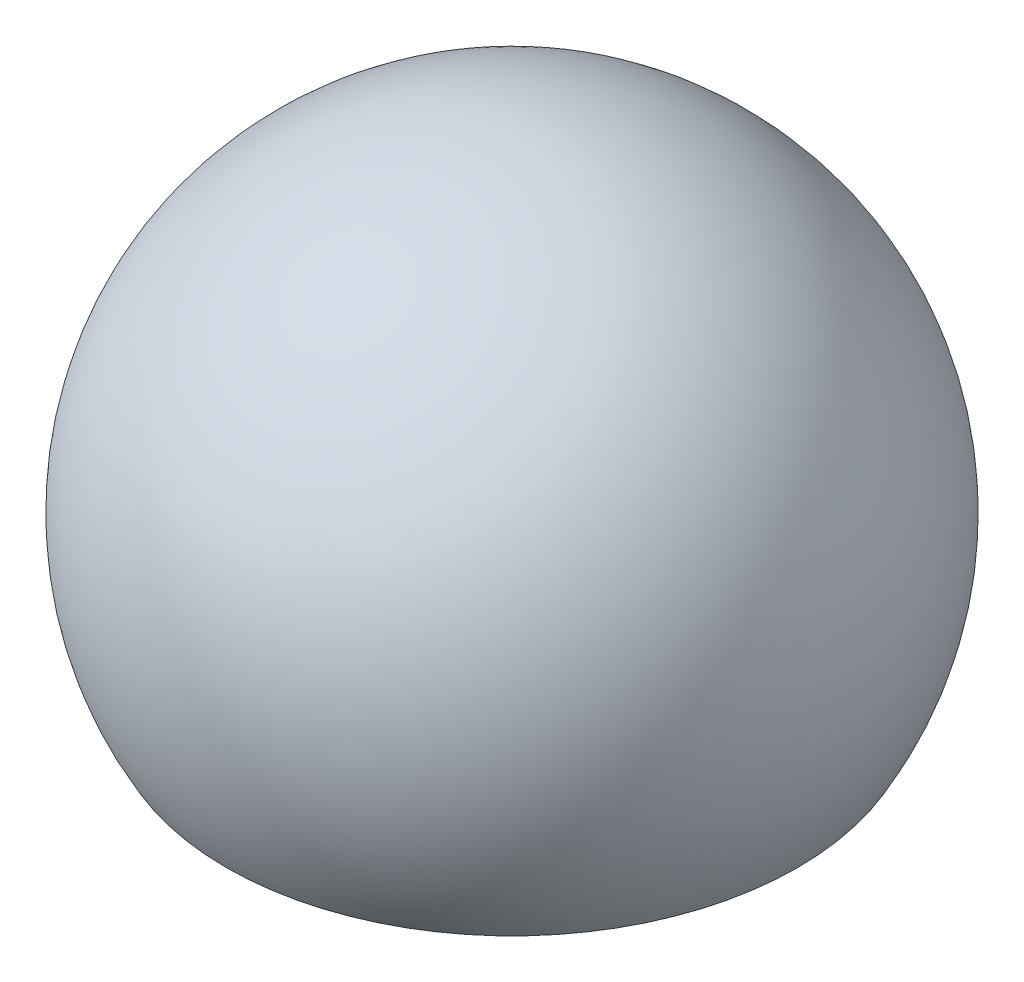
ISO-10303-21;
HEADER;
FILE_DESCRIPTION(('STEP AP214'),'2;1');
FILE_NAME('part.step','',(''),(''),'','','');
FILE_SCHEMA(('AUTOMOTIVE_DESIGN { 1 0 10303 214 1 1 1 1 }'));
ENDSEC;
DATA;
#1=APPLICATION_CONTEXT('core data for automotive mechanical design processes');
#2=APPLICATION_PROTOCOL_DEFINITION('international standard','automotive_design',2000,#1);
#3=PRODUCT_CONTEXT('',#1,'mechanical');
#4=PRODUCT('Part','Part','',(#3));
#5=PRODUCT_RELATED_PRODUCT_CATEGORY('part','',(#4));
#6=PRODUCT_DEFINITION_FORMATION('','',#4);
#7=PRODUCT_DEFINITION_CONTEXT('part definition',#1,'design');
#8=PRODUCT_DEFINITION('design','',#6,#7);
#9=PRODUCT_DEFINITION_SHAPE('','',#8);
#10=(LENGTH_UNIT() NAMED_UNIT(*) SI_UNIT(.MILLI.,.METRE.));
#11=(NAMED_UNIT(*) PLANE_ANGLE_UNIT() SI_UNIT($,.RADIAN.));
#12=(NAMED_UNIT(*) SI_UNIT($,.STERADIAN.) SOLID_ANGLE_UNIT());
#13=UNCERTAINTY_MEASURE_WITH_UNIT(LENGTH_MEASURE(1.E-05),#10,'distance_accuracy_value','');
#14=(GEOMETRIC_REPRESENTATION_CONTEXT(3) GLOBAL_UNCERTAINTY_ASSIGNED_CONTEXT((#13)) GLOBAL_UNIT_ASSIGNED_CONTEXT((#10,
#11,#12)) REPRESENTATION_CONTEXT('',''));
#15=CARTESIAN_POINT('',(0.,0.,0.));
#16=DIRECTION('',(0.,0.,1.));
#17=DIRECTION('',(1.,0.,0.));
#18=AXIS2_PLACEMENT_3D('',#15,#16,#17);
#19=CARTESIAN_POINT('',(0.,0.,0.));
#20=DIRECTION('',(0.,1.,0.));
#21=DIRECTION('',(1.,0.,0.));
#22=AXIS2_PLACEMENT_3D('',#19,#20,#21);
#23=SPHERICAL_SURFACE('',#22,12.7);
#24=CARTESIAN_POINT('',(0.,-6.35,0.));
#25=DIRECTION('',(0.,1.,0.));
#26=DIRECTION('',(0.,0.,1.));
#27=AXIS2_PLACEMENT_3D('',#24,#25,#26);
#28=CIRCLE('',#27,10.9985226280624);
#29=CARTESIAN_POINT('',(0.,-6.35,10.9985226280624));
#30=VERTEX_POINT('',#29);
#31=EDGE_CURVE('E59',#30,#30,#28,.T.);
#32=ORIENTED_EDGE('',*,*,#31,.T.);
#33=EDGE_LOOP('',(#32));
#34=FACE_BOUND('',#33,.T.);
#35=ADVANCED_FACE('F49',(#34),#23,.T.);
#36=CARTESIAN_POINT('',(-10.9985226280624,-6.35,-12.7));
#37=DIRECTION('',(0.,1.,0.));
#38=DIRECTION('',(0.,0.,1.));
#39=AXIS2_PLACEMENT_3D('',#36,#37,#38);
#40=PLANE('',#39);
#41=CARTESIAN_POINT('',(0.,-6.35,0.));
#42=DIRECTION('',(0.,-1.,0.));
#43=DIRECTION('',(0.,0.,-1.));
#44=AXIS2_PLACEMENT_3D('',#41,#42,#43);
#45=CIRCLE('',#44,8.4582);
#46=CARTESIAN_POINT('',(0.,-6.35,-8.4582));
#47=VERTEX_POINT('',#46);
#48=EDGE_CURVE('E68',#47,#47,#45,.T.);
#49=ORIENTED_EDGE('',*,*,#48,.F.);
#50=EDGE_LOOP('',(#49));
#51=FACE_BOUND('',#50,.T.);
#52=ORIENTED_EDGE('',*,*,#31,.F.);
#53=EDGE_LOOP('',(#52));
#54=FACE_BOUND('',#53,.T.);
#55=ADVANCED_FACE('F90',(#51,#54),#40,.F.);
#56=CARTESIAN_POINT('',(0.,-6.223,0.));
#57=DIRECTION('',(0.,-1.,0.));
#58=DIRECTION('',(0.,0.,-1.));
#59=AXIS2_PLACEMENT_3D('',#56,#57,#58);
#60=CYLINDRICAL_SURFACE('',#59,8.4582);
#61=CARTESIAN_POINT('',(0.,-6.223,0.));
#62=DIRECTION('',(0.,-1.,0.));
#63=DIRECTION('',(0.,0.,-1.));
#64=AXIS2_PLACEMENT_3D('',#61,#62,#63);
#65=CIRCLE('',#64,8.4582);
#66=CARTESIAN_POINT('',(0.,-6.223,-8.4582));
#67=VERTEX_POINT('',#66);
#68=EDGE_CURVE('E63',#67,#67,#65,.T.);
#69=ORIENTED_EDGE('',*,*,#68,.F.);
#70=EDGE_LOOP('',(#69));
#71=FACE_BOUND('',#70,.T.);
#72=ORIENTED_EDGE('',*,*,#48,.T.);
#73=EDGE_LOOP('',(#72));
#74=FACE_BOUND('',#73,.T.);
#75=ADVANCED_FACE('F87',(#71,#74),#60,.F.);
#76=CARTESIAN_POINT('',(0.,-6.223,0.));
#77=DIRECTION('',(0.,-1.,0.));
#78=DIRECTION('',(0.,0.,-1.));
#79=AXIS2_PLACEMENT_3D('',#76,#77,#78);
#80=PLANE('',#79);
#81=CARTESIAN_POINT('',(0.,-6.223,0.));
#82=DIRECTION('',(0.,-1.,0.));
#83=DIRECTION('',(0.,0.,-1.));
#84=AXIS2_PLACEMENT_3D('',#81,#82,#83);
#85=CIRCLE('',#84,3.175);
#86=CARTESIAN_POINT('',(0.,-6.223,-3.175));
#87=VERTEX_POINT('',#86);
#88=EDGE_CURVE('E12',#87,#87,#85,.F.);
#89=ORIENTED_EDGE('',*,*,#88,.T.);
#90=EDGE_LOOP('',(#89));
#91=FACE_BOUND('',#90,.T.);
#92=ORIENTED_EDGE('',*,*,#68,.T.);
#93=EDGE_LOOP('',(#92));
#94=FACE_BOUND('',#93,.T.);
#95=ADVANCED_FACE('F79',(#91,#94),#80,.T.);
#96=CARTESIAN_POINT('',(0.,0.126999999999999,0.));
#97=DIRECTION('',(0.,-1.,0.));
#98=DIRECTION('',(0.,0.,-1.));
#99=AXIS2_PLACEMENT_3D('',#96,#97,#98);
#100=CYLINDRICAL_SURFACE('',#99,2.54);
#101=CARTESIAN_POINT('',(0.,-5.58800000000001,0.));
#102=DIRECTION('',(0.,-1.,0.));
#103=DIRECTION('',(0.,0.,-1.));
#104=AXIS2_PLACEMENT_3D('',#101,#102,#103);
#105=CIRCLE('',#104,2.54);
#106=CARTESIAN_POINT('',(0.,-5.58800000000001,-2.54));
#107=VERTEX_POINT('',#106);
#108=EDGE_CURVE('E55',#107,#107,#105,.T.);
#109=ORIENTED_EDGE('',*,*,#108,.T.);
#110=EDGE_LOOP('',(#109));
#111=FACE_BOUND('',#110,.T.);
#112=CARTESIAN_POINT('',(0.,0.126999999999999,0.));
#113=DIRECTION('',(0.,-1.,0.));
#114=DIRECTION('',(0.,0.,-1.));
#115=AXIS2_PLACEMENT_3D('',#112,#113,#114);
#116=CIRCLE('',#115,2.54);
#117=CARTESIAN_POINT('',(0.,0.126999999999999,-2.54));
#118=VERTEX_POINT('',#117);
#119=EDGE_CURVE('E71',#118,#118,#116,.T.);
#120=ORIENTED_EDGE('',*,*,#119,.F.);
#121=EDGE_LOOP('',(#120));
#122=FACE_BOUND('',#121,.T.);
#123=ADVANCED_FACE('F77',(#111,#122),#100,.F.);
#124=CARTESIAN_POINT('',(0.,0.126999999999999,0.));
#125=DIRECTION('',(0.,-1.,0.));
#126=DIRECTION('',(0.,0.,-1.));
#127=AXIS2_PLACEMENT_3D('',#124,#125,#126);
#128=PLANE('',#127);
#129=ORIENTED_EDGE('',*,*,#119,.T.);
#130=EDGE_LOOP('',(#129));
#131=FACE_BOUND('',#130,.T.);
#132=ADVANCED_FACE('F75',(#131),#128,.T.);
#133=CARTESIAN_POINT('',(0.,-5.58800000000001,0.));
#134=DIRECTION('',(0.,-1.,0.));
#135=DIRECTION('',(0.,0.,-1.));
#136=AXIS2_PLACEMENT_3D('',#133,#134,#135);
#137=CONICAL_SURFACE('',#136,2.54,0.78539816339745);
#138=ORIENTED_EDGE('',*,*,#88,.F.);
#139=EDGE_LOOP('',(#138));
#140=FACE_BOUND('',#139,.T.);
#141=ORIENTED_EDGE('',*,*,#108,.F.);
#142=EDGE_LOOP('',(#141));
#143=FACE_BOUND('',#142,.T.);
#144=ADVANCED_FACE('F85',(#140,#143),#137,.F.);
#145=CLOSED_SHELL('',(#35,#55,#75,#95,#123,#132,#144));
#146=MANIFOLD_SOLID_BREP('B2',#145);
#147=ADVANCED_BREP_SHAPE_REPRESENTATION('',(#18,#146),#14);
#148=SHAPE_DEFINITION_REPRESENTATION(#9,#147);
ENDSEC;
END-ISO-10303-21;
